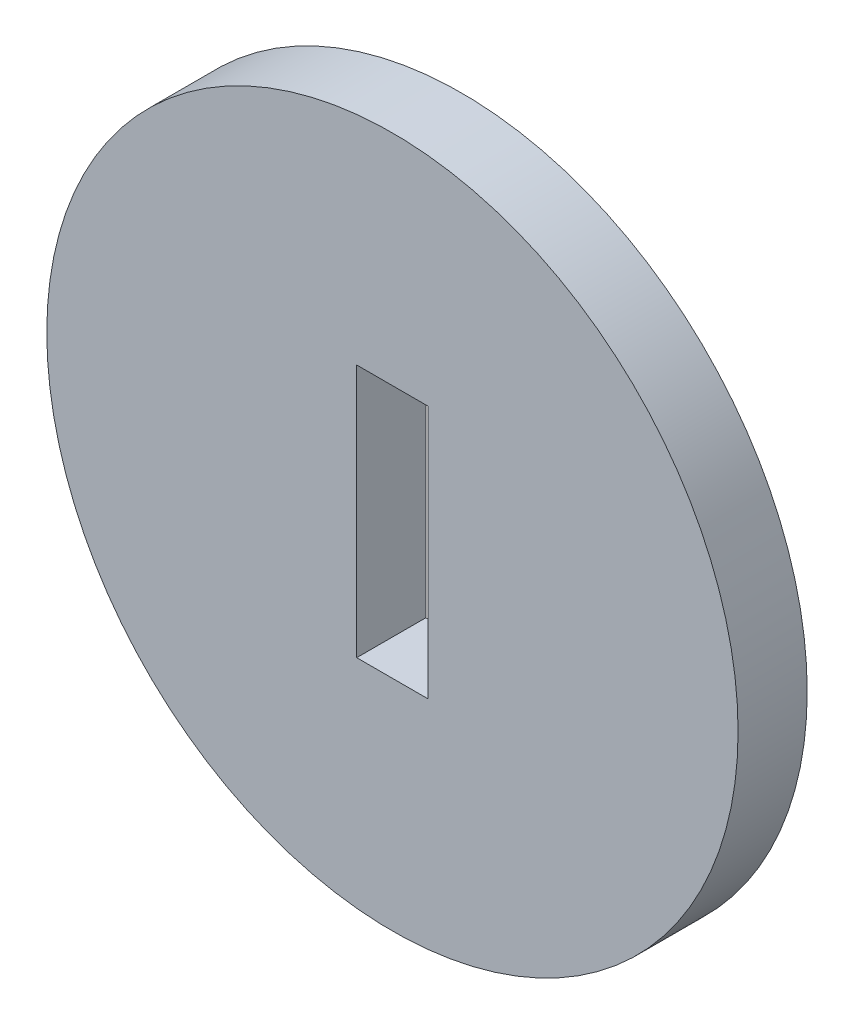
ISO-10303-21;
HEADER;
FILE_DESCRIPTION(('STEP AP214'),'2;1');
FILE_NAME('part.step','',(''),(''),'','','');
FILE_SCHEMA(('AUTOMOTIVE_DESIGN { 1 0 10303 214 1 1 1 1 }'));
ENDSEC;
DATA;
#1=APPLICATION_CONTEXT('core data for automotive mechanical design processes');
#2=APPLICATION_PROTOCOL_DEFINITION('international standard','automotive_design',2000,#1);
#3=PRODUCT_CONTEXT('',#1,'mechanical');
#4=PRODUCT('Part','Part','',(#3));
#5=PRODUCT_RELATED_PRODUCT_CATEGORY('part','',(#4));
#6=PRODUCT_DEFINITION_FORMATION('','',#4);
#7=PRODUCT_DEFINITION_CONTEXT('part definition',#1,'design');
#8=PRODUCT_DEFINITION('design','',#6,#7);
#9=PRODUCT_DEFINITION_SHAPE('','',#8);
#10=(LENGTH_UNIT() NAMED_UNIT(*) SI_UNIT(.MILLI.,.METRE.));
#11=(NAMED_UNIT(*) PLANE_ANGLE_UNIT() SI_UNIT($,.RADIAN.));
#12=(NAMED_UNIT(*) SI_UNIT($,.STERADIAN.) SOLID_ANGLE_UNIT());
#13=UNCERTAINTY_MEASURE_WITH_UNIT(LENGTH_MEASURE(1.E-05),#10,'distance_accuracy_value','');
#14=(GEOMETRIC_REPRESENTATION_CONTEXT(3) GLOBAL_UNCERTAINTY_ASSIGNED_CONTEXT((#13)) GLOBAL_UNIT_ASSIGNED_CONTEXT((#10,
#11,#12)) REPRESENTATION_CONTEXT('',''));
#15=CARTESIAN_POINT('',(0.,0.,0.));
#16=DIRECTION('',(0.,0.,1.));
#17=DIRECTION('',(1.,0.,0.));
#18=AXIS2_PLACEMENT_3D('',#15,#16,#17);
#19=CARTESIAN_POINT('',(0.,0.,3.));
#20=DIRECTION('',(0.,0.,-1.));
#21=DIRECTION('',(-1.,0.,0.));
#22=AXIS2_PLACEMENT_3D('',#19,#20,#21);
#23=CYLINDRICAL_SURFACE('',#22,15.);
#24=CARTESIAN_POINT('',(0.,0.,3.));
#25=DIRECTION('',(0.,0.,1.));
#26=DIRECTION('',(1.,0.,0.));
#27=AXIS2_PLACEMENT_3D('',#24,#25,#26);
#28=CIRCLE('',#27,15.);
#29=CARTESIAN_POINT('',(15.,0.,3.));
#30=VERTEX_POINT('',#29);
#31=EDGE_CURVE('E11',#30,#30,#28,.T.);
#32=ORIENTED_EDGE('',*,*,#31,.F.);
#33=EDGE_LOOP('',(#32));
#34=FACE_BOUND('',#33,.T.);
#35=CARTESIAN_POINT('',(0.,0.,0.));
#36=DIRECTION('',(0.,0.,1.));
#37=DIRECTION('',(1.,0.,0.));
#38=AXIS2_PLACEMENT_3D('',#35,#36,#37);
#39=CIRCLE('',#38,15.);
#40=CARTESIAN_POINT('',(15.,0.,0.));
#41=VERTEX_POINT('',#40);
#42=EDGE_CURVE('E36',#41,#41,#39,.T.);
#43=ORIENTED_EDGE('',*,*,#42,.T.);
#44=EDGE_LOOP('',(#43));
#45=FACE_BOUND('',#44,.T.);
#46=ADVANCED_FACE('F33',(#34,#45),#23,.T.);
#47=CARTESIAN_POINT('',(0.,0.,3.));
#48=DIRECTION('',(0.,0.,1.));
#49=DIRECTION('',(1.,0.,0.));
#50=AXIS2_PLACEMENT_3D('',#47,#48,#49);
#51=PLANE('',#50);
#52=DIRECTION('',(1.,0.,0.));
#53=VECTOR('',#52,1.);
#54=CARTESIAN_POINT('',(-1.55,5.5,3.));
#55=LINE('',#54,#53);
#56=CARTESIAN_POINT('',(-1.55,5.5,3.));
#57=VERTEX_POINT('',#56);
#58=CARTESIAN_POINT('',(1.55,5.5,3.));
#59=VERTEX_POINT('',#58);
#60=EDGE_CURVE('E75',#57,#59,#55,.T.);
#61=ORIENTED_EDGE('',*,*,#60,.T.);
#62=DIRECTION('',(0.,-1.,0.));
#63=VECTOR('',#62,1.);
#64=CARTESIAN_POINT('',(1.55,5.5,3.));
#65=LINE('',#64,#63);
#66=CARTESIAN_POINT('',(1.55,-5.5,3.));
#67=VERTEX_POINT('',#66);
#68=EDGE_CURVE('E81',#59,#67,#65,.T.);
#69=ORIENTED_EDGE('',*,*,#68,.T.);
#70=DIRECTION('',(1.,0.,0.));
#71=VECTOR('',#70,1.);
#72=CARTESIAN_POINT('',(-1.55,-5.5,3.));
#73=LINE('',#72,#71);
#74=CARTESIAN_POINT('',(-1.55,-5.5,3.));
#75=VERTEX_POINT('',#74);
#76=EDGE_CURVE('E85',#75,#67,#73,.T.);
#77=ORIENTED_EDGE('',*,*,#76,.F.);
#78=DIRECTION('',(0.,-1.,0.));
#79=VECTOR('',#78,1.);
#80=CARTESIAN_POINT('',(-1.55,5.5,3.));
#81=LINE('',#80,#79);
#82=EDGE_CURVE('E78',#57,#75,#81,.T.);
#83=ORIENTED_EDGE('',*,*,#82,.F.);
#84=EDGE_LOOP('',(#61,#69,#77,#83));
#85=FACE_BOUND('',#84,.T.);
#86=ORIENTED_EDGE('',*,*,#31,.T.);
#87=EDGE_LOOP('',(#86));
#88=FACE_BOUND('',#87,.T.);
#89=ADVANCED_FACE('F87',(#85,#88),#51,.T.);
#90=CARTESIAN_POINT('',(0.,0.,0.));
#91=DIRECTION('',(0.,0.,1.));
#92=DIRECTION('',(1.,0.,0.));
#93=AXIS2_PLACEMENT_3D('',#90,#91,#92);
#94=PLANE('',#93);
#95=DIRECTION('',(0.,-1.,0.));
#96=VECTOR('',#95,1.);
#97=CARTESIAN_POINT('',(1.55,5.5,0.));
#98=LINE('',#97,#96);
#99=CARTESIAN_POINT('',(1.55,5.5,0.));
#100=VERTEX_POINT('',#99);
#101=CARTESIAN_POINT('',(1.55,-5.5,0.));
#102=VERTEX_POINT('',#101);
#103=EDGE_CURVE('E98',#100,#102,#98,.T.);
#104=ORIENTED_EDGE('',*,*,#103,.F.);
#105=DIRECTION('',(1.,0.,0.));
#106=VECTOR('',#105,1.);
#107=CARTESIAN_POINT('',(-1.55,5.5,0.));
#108=LINE('',#107,#106);
#109=CARTESIAN_POINT('',(-1.55,5.5,0.));
#110=VERTEX_POINT('',#109);
#111=EDGE_CURVE('E55',#110,#100,#108,.T.);
#112=ORIENTED_EDGE('',*,*,#111,.F.);
#113=DIRECTION('',(0.,-1.,0.));
#114=VECTOR('',#113,1.);
#115=CARTESIAN_POINT('',(-1.55,5.5,0.));
#116=LINE('',#115,#114);
#117=CARTESIAN_POINT('',(-1.55,-5.5,0.));
#118=VERTEX_POINT('',#117);
#119=EDGE_CURVE('E89',#110,#118,#116,.T.);
#120=ORIENTED_EDGE('',*,*,#119,.T.);
#121=DIRECTION('',(1.,0.,0.));
#122=VECTOR('',#121,1.);
#123=CARTESIAN_POINT('',(-1.55,-5.5,0.));
#124=LINE('',#123,#122);
#125=EDGE_CURVE('E92',#118,#102,#124,.T.);
#126=ORIENTED_EDGE('',*,*,#125,.T.);
#127=EDGE_LOOP('',(#104,#112,#120,#126));
#128=FACE_BOUND('',#127,.T.);
#129=ORIENTED_EDGE('',*,*,#42,.F.);
#130=EDGE_LOOP('',(#129));
#131=FACE_BOUND('',#130,.T.);
#132=ADVANCED_FACE('F111',(#128,#131),#94,.F.);
#133=CARTESIAN_POINT('',(-1.55,5.5,3.));
#134=DIRECTION('',(0.,1.,0.));
#135=DIRECTION('',(0.,0.,1.));
#136=AXIS2_PLACEMENT_3D('',#133,#134,#135);
#137=PLANE('',#136);
#138=ORIENTED_EDGE('',*,*,#111,.T.);
#139=DIRECTION('',(0.,0.,-1.));
#140=VECTOR('',#139,1.);
#141=CARTESIAN_POINT('',(1.55,5.5,3.));
#142=LINE('',#141,#140);
#143=EDGE_CURVE('E72',#59,#100,#142,.T.);
#144=ORIENTED_EDGE('',*,*,#143,.F.);
#145=ORIENTED_EDGE('',*,*,#60,.F.);
#146=DIRECTION('',(0.,0.,-1.));
#147=VECTOR('',#146,1.);
#148=CARTESIAN_POINT('',(-1.55,5.5,3.));
#149=LINE('',#148,#147);
#150=EDGE_CURVE('E102',#57,#110,#149,.T.);
#151=ORIENTED_EDGE('',*,*,#150,.T.);
#152=EDGE_LOOP('',(#138,#144,#145,#151));
#153=FACE_BOUND('',#152,.T.);
#154=ADVANCED_FACE('F73',(#153),#137,.F.);
#155=CARTESIAN_POINT('',(-1.55,5.5,3.));
#156=DIRECTION('',(1.,0.,0.));
#157=DIRECTION('',(0.,1.,0.));
#158=AXIS2_PLACEMENT_3D('',#155,#156,#157);
#159=PLANE('',#158);
#160=ORIENTED_EDGE('',*,*,#119,.F.);
#161=ORIENTED_EDGE('',*,*,#150,.F.);
#162=ORIENTED_EDGE('',*,*,#82,.T.);
#163=DIRECTION('',(0.,0.,-1.));
#164=VECTOR('',#163,1.);
#165=CARTESIAN_POINT('',(-1.55,-5.5,3.));
#166=LINE('',#165,#164);
#167=EDGE_CURVE('E104',#75,#118,#166,.T.);
#168=ORIENTED_EDGE('',*,*,#167,.T.);
#169=EDGE_LOOP('',(#160,#161,#162,#168));
#170=FACE_BOUND('',#169,.T.);
#171=ADVANCED_FACE('F115',(#170),#159,.T.);
#172=CARTESIAN_POINT('',(-1.55,-5.5,3.));
#173=DIRECTION('',(0.,1.,0.));
#174=DIRECTION('',(0.,0.,1.));
#175=AXIS2_PLACEMENT_3D('',#172,#173,#174);
#176=PLANE('',#175);
#177=ORIENTED_EDGE('',*,*,#125,.F.);
#178=ORIENTED_EDGE('',*,*,#167,.F.);
#179=ORIENTED_EDGE('',*,*,#76,.T.);
#180=DIRECTION('',(0.,0.,-1.));
#181=VECTOR('',#180,1.);
#182=CARTESIAN_POINT('',(1.55,-5.5,3.));
#183=LINE('',#182,#181);
#184=EDGE_CURVE('E47',#67,#102,#183,.T.);
#185=ORIENTED_EDGE('',*,*,#184,.T.);
#186=EDGE_LOOP('',(#177,#178,#179,#185));
#187=FACE_BOUND('',#186,.T.);
#188=ADVANCED_FACE('F108',(#187),#176,.T.);
#189=CARTESIAN_POINT('',(1.55,5.5,3.));
#190=DIRECTION('',(1.,0.,0.));
#191=DIRECTION('',(0.,1.,0.));
#192=AXIS2_PLACEMENT_3D('',#189,#190,#191);
#193=PLANE('',#192);
#194=ORIENTED_EDGE('',*,*,#103,.T.);
#195=ORIENTED_EDGE('',*,*,#184,.F.);
#196=ORIENTED_EDGE('',*,*,#68,.F.);
#197=ORIENTED_EDGE('',*,*,#143,.T.);
#198=EDGE_LOOP('',(#194,#195,#196,#197));
#199=FACE_BOUND('',#198,.T.);
#200=ADVANCED_FACE('F82',(#199),#193,.F.);
#201=CLOSED_SHELL('',(#46,#89,#132,#154,#171,#188,#200));
#202=MANIFOLD_SOLID_BREP('B2',#201);
#203=ADVANCED_BREP_SHAPE_REPRESENTATION('',(#18,#202),#14);
#204=SHAPE_DEFINITION_REPRESENTATION(#9,#203);
ENDSEC;
END-ISO-10303-21;
